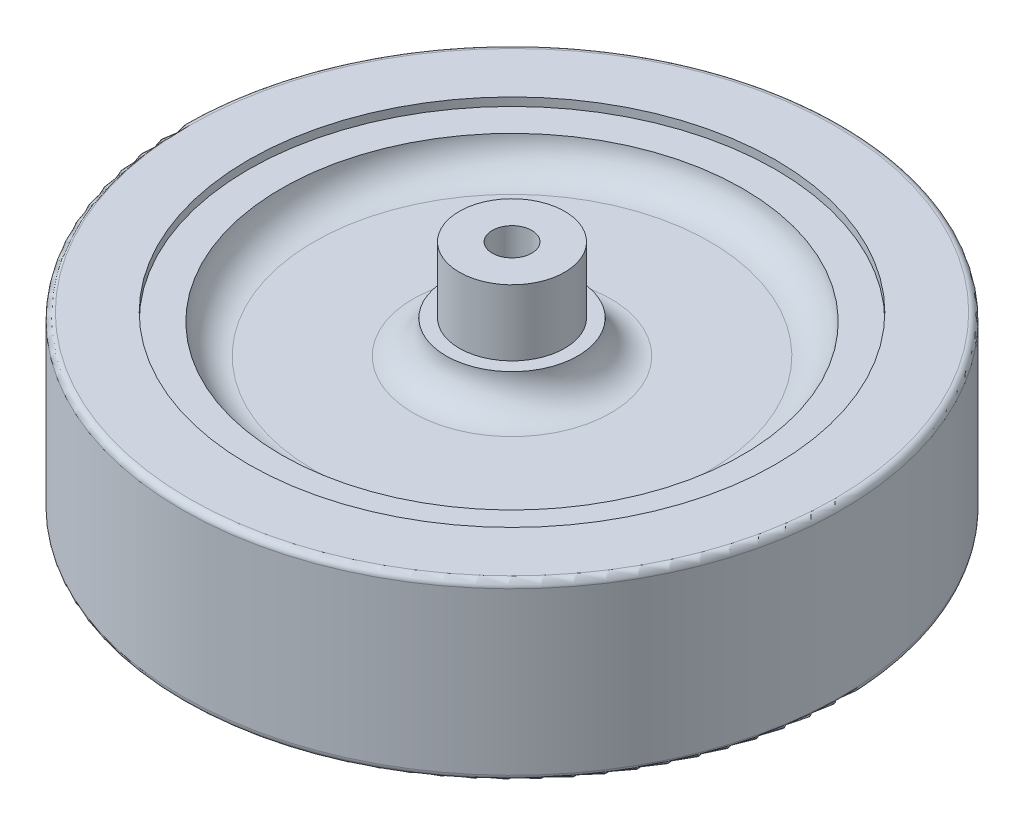
ISO-10303-21;
HEADER;
FILE_DESCRIPTION(('STEP AP214'),'2;1');
FILE_NAME('part.step','',(''),(''),'','','');
FILE_SCHEMA(('AUTOMOTIVE_DESIGN { 1 0 10303 214 1 1 1 1 }'));
ENDSEC;
DATA;
#1=APPLICATION_CONTEXT('core data for automotive mechanical design processes');
#2=APPLICATION_PROTOCOL_DEFINITION('international standard','automotive_design',2000,#1);
#3=PRODUCT_CONTEXT('',#1,'mechanical');
#4=PRODUCT('Part','Part','',(#3));
#5=PRODUCT_RELATED_PRODUCT_CATEGORY('part','',(#4));
#6=PRODUCT_DEFINITION_FORMATION('','',#4);
#7=PRODUCT_DEFINITION_CONTEXT('part definition',#1,'design');
#8=PRODUCT_DEFINITION('design','',#6,#7);
#9=PRODUCT_DEFINITION_SHAPE('','',#8);
#10=(LENGTH_UNIT() NAMED_UNIT(*) SI_UNIT(.MILLI.,.METRE.));
#11=(NAMED_UNIT(*) PLANE_ANGLE_UNIT() SI_UNIT($,.RADIAN.));
#12=(NAMED_UNIT(*) SI_UNIT($,.STERADIAN.) SOLID_ANGLE_UNIT());
#13=UNCERTAINTY_MEASURE_WITH_UNIT(LENGTH_MEASURE(1.E-05),#10,'distance_accuracy_value','');
#14=(GEOMETRIC_REPRESENTATION_CONTEXT(3) GLOBAL_UNCERTAINTY_ASSIGNED_CONTEXT((#13)) GLOBAL_UNIT_ASSIGNED_CONTEXT((#10,
#11,#12)) REPRESENTATION_CONTEXT('',''));
#15=CARTESIAN_POINT('',(0.,0.,0.));
#16=DIRECTION('',(0.,0.,1.));
#17=DIRECTION('',(1.,0.,0.));
#18=AXIS2_PLACEMENT_3D('',#15,#16,#17);
#19=CARTESIAN_POINT('',(0.,22.5,0.));
#20=DIRECTION('',(0.,1.,0.));
#21=DIRECTION('',(0.,0.,1.));
#22=AXIS2_PLACEMENT_3D('',#19,#20,#21);
#23=PLANE('',#22);
#24=CARTESIAN_POINT('',(0.,22.5,0.));
#25=DIRECTION('',(0.,1.,0.));
#26=DIRECTION('',(0.,0.,1.));
#27=AXIS2_PLACEMENT_3D('',#24,#25,#26);
#28=CIRCLE('',#27,8.);
#29=CARTESIAN_POINT('',(0.,22.5,8.));
#30=VERTEX_POINT('',#29);
#31=EDGE_CURVE('E87',#30,#30,#28,.T.);
#32=ORIENTED_EDGE('',*,*,#31,.T.);
#33=EDGE_LOOP('',(#32));
#34=FACE_BOUND('',#33,.T.);
#35=CARTESIAN_POINT('',(0.,22.5,0.));
#36=DIRECTION('',(0.,1.,0.));
#37=DIRECTION('',(0.,0.,1.));
#38=AXIS2_PLACEMENT_3D('',#35,#36,#37);
#39=CIRCLE('',#38,3.);
#40=CARTESIAN_POINT('',(0.,22.5,3.));
#41=VERTEX_POINT('',#40);
#42=EDGE_CURVE('E93',#41,#41,#39,.T.);
#43=ORIENTED_EDGE('',*,*,#42,.F.);
#44=EDGE_LOOP('',(#43));
#45=FACE_BOUND('',#44,.T.);
#46=ADVANCED_FACE('F33',(#34,#45),#23,.T.);
#47=CARTESIAN_POINT('',(0.,12.5,0.));
#48=DIRECTION('',(0.,1.,0.));
#49=DIRECTION('',(0.,0.,1.));
#50=AXIS2_PLACEMENT_3D('',#47,#48,#49);
#51=PLANE('',#50);
#52=CARTESIAN_POINT('',(0.,12.5,0.));
#53=DIRECTION('',(0.,1.,0.));
#54=DIRECTION('',(0.,0.,1.));
#55=AXIS2_PLACEMENT_3D('',#52,#53,#54);
#56=CIRCLE('',#55,10.);
#57=CARTESIAN_POINT('',(0.,12.5,10.));
#58=VERTEX_POINT('',#57);
#59=EDGE_CURVE('E81',#58,#58,#56,.T.);
#60=ORIENTED_EDGE('',*,*,#59,.T.);
#61=EDGE_LOOP('',(#60));
#62=FACE_BOUND('',#61,.T.);
#63=CARTESIAN_POINT('',(0.,12.5,0.));
#64=DIRECTION('',(0.,1.,0.));
#65=DIRECTION('',(0.,0.,1.));
#66=AXIS2_PLACEMENT_3D('',#63,#64,#65);
#67=CIRCLE('',#66,8.);
#68=CARTESIAN_POINT('',(0.,12.5,8.));
#69=VERTEX_POINT('',#68);
#70=EDGE_CURVE('E90',#69,#69,#67,.T.);
#71=ORIENTED_EDGE('',*,*,#70,.F.);
#72=EDGE_LOOP('',(#71));
#73=FACE_BOUND('',#72,.T.);
#74=ADVANCED_FACE('F106',(#62,#73),#51,.T.);
#75=CARTESIAN_POINT('',(0.,13.25,0.));
#76=DIRECTION('',(0.,-1.,0.));
#77=DIRECTION('',(0.,0.,-1.));
#78=AXIS2_PLACEMENT_3D('',#75,#76,#77);
#79=CYLINDRICAL_SURFACE('',#78,40.);
#80=CARTESIAN_POINT('',(0.,-13.25,0.));
#81=DIRECTION('',(0.,1.,0.));
#82=DIRECTION('',(0.,0.,1.));
#83=AXIS2_PLACEMENT_3D('',#80,#81,#82);
#84=CIRCLE('',#83,40.);
#85=CARTESIAN_POINT('',(0.,-13.25,40.));
#86=VERTEX_POINT('',#85);
#87=EDGE_CURVE('E69',#86,#86,#84,.T.);
#88=ORIENTED_EDGE('',*,*,#87,.F.);
#89=EDGE_LOOP('',(#88));
#90=FACE_BOUND('',#89,.T.);
#91=CARTESIAN_POINT('',(0.,-12.,0.));
#92=DIRECTION('',(0.,1.,0.));
#93=DIRECTION('',(0.,0.,1.));
#94=AXIS2_PLACEMENT_3D('',#91,#92,#93);
#95=CIRCLE('',#94,40.);
#96=CARTESIAN_POINT('',(0.,-12.,40.));
#97=VERTEX_POINT('',#96);
#98=EDGE_CURVE('E72',#97,#97,#95,.T.);
#99=ORIENTED_EDGE('',*,*,#98,.T.);
#100=EDGE_LOOP('',(#99));
#101=FACE_BOUND('',#100,.T.);
#102=ADVANCED_FACE('F112',(#90,#101),#79,.F.);
#103=CARTESIAN_POINT('',(0.,13.25,0.));
#104=DIRECTION('',(0.,1.,0.));
#105=DIRECTION('',(0.,0.,1.));
#106=AXIS2_PLACEMENT_3D('',#103,#104,#105);
#107=PLANE('',#106);
#108=CARTESIAN_POINT('',(0.,13.25,0.));
#109=DIRECTION('',(0.,1.,0.));
#110=DIRECTION('',(0.,0.,1.));
#111=AXIS2_PLACEMENT_3D('',#108,#109,#110);
#112=CIRCLE('',#111,49.);
#113=CARTESIAN_POINT('',(0.,13.25,49.));
#114=VERTEX_POINT('',#113);
#115=EDGE_CURVE('E10',#114,#114,#112,.T.);
#116=ORIENTED_EDGE('',*,*,#115,.T.);
#117=EDGE_LOOP('',(#116));
#118=FACE_BOUND('',#117,.T.);
#119=CARTESIAN_POINT('',(0.,13.25,0.));
#120=DIRECTION('',(0.,1.,0.));
#121=DIRECTION('',(0.,0.,1.));
#122=AXIS2_PLACEMENT_3D('',#119,#120,#121);
#123=CIRCLE('',#122,40.);
#124=CARTESIAN_POINT('',(0.,13.25,40.));
#125=VERTEX_POINT('',#124);
#126=EDGE_CURVE('E68',#125,#125,#123,.T.);
#127=ORIENTED_EDGE('',*,*,#126,.F.);
#128=EDGE_LOOP('',(#127));
#129=FACE_BOUND('',#128,.T.);
#130=ADVANCED_FACE('F149',(#118,#129),#107,.T.);
#131=CARTESIAN_POINT('',(0.,-13.25,0.));
#132=DIRECTION('',(0.,1.,0.));
#133=DIRECTION('',(0.,0.,1.));
#134=AXIS2_PLACEMENT_3D('',#131,#132,#133);
#135=PLANE('',#134);
#136=CARTESIAN_POINT('',(0.,-13.25,0.));
#137=DIRECTION('',(0.,1.,0.));
#138=DIRECTION('',(0.,0.,1.));
#139=AXIS2_PLACEMENT_3D('',#136,#137,#138);
#140=CIRCLE('',#139,49.);
#141=CARTESIAN_POINT('',(0.,-13.25,49.));
#142=VERTEX_POINT('',#141);
#143=EDGE_CURVE('E40',#142,#142,#140,.F.);
#144=ORIENTED_EDGE('',*,*,#143,.T.);
#145=EDGE_LOOP('',(#144));
#146=FACE_BOUND('',#145,.T.);
#147=ORIENTED_EDGE('',*,*,#87,.T.);
#148=EDGE_LOOP('',(#147));
#149=FACE_BOUND('',#148,.T.);
#150=ADVANCED_FACE('F152',(#146,#149),#135,.F.);
#151=CARTESIAN_POINT('',(0.,13.25,0.));
#152=DIRECTION('',(0.,-1.,0.));
#153=DIRECTION('',(0.,0.,-1.));
#154=AXIS2_PLACEMENT_3D('',#151,#152,#153);
#155=CYLINDRICAL_SURFACE('',#154,50.);
#156=CARTESIAN_POINT('',(0.,-12.25,0.));
#157=DIRECTION('',(0.,1.,0.));
#158=DIRECTION('',(0.,0.,1.));
#159=AXIS2_PLACEMENT_3D('',#156,#157,#158);
#160=CIRCLE('',#159,50.);
#161=CARTESIAN_POINT('',(0.,-12.25,50.));
#162=VERTEX_POINT('',#161);
#163=EDGE_CURVE('E44',#162,#162,#160,.T.);
#164=ORIENTED_EDGE('',*,*,#163,.T.);
#165=EDGE_LOOP('',(#164));
#166=FACE_BOUND('',#165,.T.);
#167=CARTESIAN_POINT('',(0.,12.25,0.));
#168=DIRECTION('',(0.,1.,0.));
#169=DIRECTION('',(0.,0.,1.));
#170=AXIS2_PLACEMENT_3D('',#167,#168,#169);
#171=CIRCLE('',#170,50.);
#172=CARTESIAN_POINT('',(0.,12.25,50.));
#173=VERTEX_POINT('',#172);
#174=EDGE_CURVE('E48',#173,#173,#171,.F.);
#175=ORIENTED_EDGE('',*,*,#174,.T.);
#176=EDGE_LOOP('',(#175));
#177=FACE_BOUND('',#176,.T.);
#178=ADVANCED_FACE('F147',(#166,#177),#155,.T.);
#179=CARTESIAN_POINT('',(0.,12.,0.));
#180=DIRECTION('',(0.,1.,0.));
#181=DIRECTION('',(0.,0.,1.));
#182=AXIS2_PLACEMENT_3D('',#179,#180,#181);
#183=CIRCLE('',#182,40.);
#184=CARTESIAN_POINT('',(0.,12.,40.));
#185=VERTEX_POINT('',#184);
#186=EDGE_CURVE('E65',#185,#185,#183,.T.);
#187=ORIENTED_EDGE('',*,*,#186,.F.);
#188=EDGE_LOOP('',(#187));
#189=FACE_BOUND('',#188,.T.);
#190=ORIENTED_EDGE('',*,*,#126,.T.);
#191=EDGE_LOOP('',(#190));
#192=FACE_BOUND('',#191,.T.);
#193=ADVANCED_FACE('F140',(#189,#192),#79,.F.);
#194=CARTESIAN_POINT('',(0.,12.,0.));
#195=DIRECTION('',(0.,1.,0.));
#196=DIRECTION('',(0.,0.,1.));
#197=AXIS2_PLACEMENT_3D('',#194,#195,#196);
#198=PLANE('',#197);
#199=ORIENTED_EDGE('',*,*,#186,.T.);
#200=EDGE_LOOP('',(#199));
#201=FACE_BOUND('',#200,.T.);
#202=CARTESIAN_POINT('',(0.,12.,0.));
#203=DIRECTION('',(0.,1.,0.));
#204=DIRECTION('',(0.,0.,1.));
#205=AXIS2_PLACEMENT_3D('',#202,#203,#204);
#206=CIRCLE('',#205,35.);
#207=CARTESIAN_POINT('',(0.,12.,35.));
#208=VERTEX_POINT('',#207);
#209=EDGE_CURVE('E77',#208,#208,#206,.T.);
#210=ORIENTED_EDGE('',*,*,#209,.F.);
#211=EDGE_LOOP('',(#210));
#212=FACE_BOUND('',#211,.T.);
#213=ADVANCED_FACE('F137',(#201,#212),#198,.T.);
#214=CARTESIAN_POINT('',(0.,-12.,0.));
#215=DIRECTION('',(0.,1.,0.));
#216=DIRECTION('',(0.,0.,1.));
#217=AXIS2_PLACEMENT_3D('',#214,#215,#216);
#218=PLANE('',#217);
#219=ORIENTED_EDGE('',*,*,#98,.F.);
#220=EDGE_LOOP('',(#219));
#221=FACE_BOUND('',#220,.T.);
#222=CARTESIAN_POINT('',(0.,-12.,0.));
#223=DIRECTION('',(0.,1.,0.));
#224=DIRECTION('',(0.,0.,1.));
#225=AXIS2_PLACEMENT_3D('',#222,#223,#224);
#226=CIRCLE('',#225,35.);
#227=CARTESIAN_POINT('',(0.,-12.,35.));
#228=VERTEX_POINT('',#227);
#229=EDGE_CURVE('E78',#228,#228,#226,.T.);
#230=ORIENTED_EDGE('',*,*,#229,.T.);
#231=EDGE_LOOP('',(#230));
#232=FACE_BOUND('',#231,.T.);
#233=ADVANCED_FACE('F132',(#221,#232),#218,.F.);
#234=CARTESIAN_POINT('',(0.,7.5,0.));
#235=DIRECTION('',(0.,1.,0.));
#236=DIRECTION('',(0.,0.,1.));
#237=AXIS2_PLACEMENT_3D('',#234,#235,#236);
#238=PLANE('',#237);
#239=CARTESIAN_POINT('',(0.,7.5,0.));
#240=DIRECTION('',(0.,1.,0.));
#241=DIRECTION('',(0.,0.,1.));
#242=AXIS2_PLACEMENT_3D('',#239,#240,#241);
#243=CIRCLE('',#242,15.);
#244=CARTESIAN_POINT('',(0.,7.5,15.));
#245=VERTEX_POINT('',#244);
#246=EDGE_CURVE('E53',#245,#245,#243,.F.);
#247=ORIENTED_EDGE('',*,*,#246,.T.);
#248=EDGE_LOOP('',(#247));
#249=FACE_BOUND('',#248,.T.);
#250=CARTESIAN_POINT('',(0.,7.5,0.));
#251=DIRECTION('',(0.,1.,0.));
#252=DIRECTION('',(0.,0.,1.));
#253=AXIS2_PLACEMENT_3D('',#250,#251,#252);
#254=CIRCLE('',#253,30.0250628144669);
#255=CARTESIAN_POINT('',(0.,7.5,30.0250628144669));
#256=VERTEX_POINT('',#255);
#257=EDGE_CURVE('E56',#256,#256,#254,.T.);
#258=ORIENTED_EDGE('',*,*,#257,.T.);
#259=EDGE_LOOP('',(#258));
#260=FACE_BOUND('',#259,.T.);
#261=ADVANCED_FACE('F129',(#249,#260),#238,.T.);
#262=CARTESIAN_POINT('',(0.,-7.5,0.));
#263=DIRECTION('',(0.,1.,0.));
#264=DIRECTION('',(0.,0.,1.));
#265=AXIS2_PLACEMENT_3D('',#262,#263,#264);
#266=PLANE('',#265);
#267=CARTESIAN_POINT('',(0.,-7.5,0.));
#268=DIRECTION('',(0.,1.,0.));
#269=DIRECTION('',(0.,0.,1.));
#270=AXIS2_PLACEMENT_3D('',#267,#268,#269);
#271=CIRCLE('',#270,30.0250628144669);
#272=CARTESIAN_POINT('',(0.,-7.5,30.0250628144669));
#273=VERTEX_POINT('',#272);
#274=EDGE_CURVE('E59',#273,#273,#271,.F.);
#275=ORIENTED_EDGE('',*,*,#274,.T.);
#276=EDGE_LOOP('',(#275));
#277=FACE_BOUND('',#276,.T.);
#278=CARTESIAN_POINT('',(0.,-7.5,0.));
#279=DIRECTION('',(0.,1.,0.));
#280=DIRECTION('',(0.,0.,1.));
#281=AXIS2_PLACEMENT_3D('',#278,#279,#280);
#282=CIRCLE('',#281,15.);
#283=CARTESIAN_POINT('',(0.,-7.5,15.));
#284=VERTEX_POINT('',#283);
#285=EDGE_CURVE('E62',#284,#284,#282,.T.);
#286=ORIENTED_EDGE('',*,*,#285,.T.);
#287=EDGE_LOOP('',(#286));
#288=FACE_BOUND('',#287,.T.);
#289=ADVANCED_FACE('F127',(#277,#288),#266,.F.);
#290=CARTESIAN_POINT('',(0.,-12.5,0.));
#291=DIRECTION('',(0.,1.,0.));
#292=DIRECTION('',(0.,0.,1.));
#293=AXIS2_PLACEMENT_3D('',#290,#291,#292);
#294=PLANE('',#293);
#295=CARTESIAN_POINT('',(0.,-12.5,0.));
#296=DIRECTION('',(0.,1.,0.));
#297=DIRECTION('',(0.,0.,1.));
#298=AXIS2_PLACEMENT_3D('',#295,#296,#297);
#299=CIRCLE('',#298,10.);
#300=CARTESIAN_POINT('',(0.,-12.5,10.));
#301=VERTEX_POINT('',#300);
#302=EDGE_CURVE('E84',#301,#301,#299,.T.);
#303=ORIENTED_EDGE('',*,*,#302,.F.);
#304=EDGE_LOOP('',(#303));
#305=FACE_BOUND('',#304,.T.);
#306=ADVANCED_FACE('F123',(#305),#294,.F.);
#307=CARTESIAN_POINT('',(0.,-12.5,0.));
#308=DIRECTION('',(0.,-1.,0.));
#309=DIRECTION('',(0.,0.,-1.));
#310=AXIS2_PLACEMENT_3D('',#307,#308,#309);
#311=TOROIDAL_SURFACE('',#310,30.0250628144669,5.);
#312=ORIENTED_EDGE('',*,*,#274,.F.);
#313=EDGE_LOOP('',(#312));
#314=FACE_BOUND('',#313,.T.);
#315=ORIENTED_EDGE('',*,*,#229,.F.);
#316=EDGE_LOOP('',(#315));
#317=FACE_BOUND('',#316,.T.);
#318=ADVANCED_FACE('F126',(#314,#317),#311,.F.);
#319=CARTESIAN_POINT('',(0.,-12.5,0.));
#320=DIRECTION('',(0.,1.,0.));
#321=DIRECTION('',(0.,0.,1.));
#322=AXIS2_PLACEMENT_3D('',#319,#320,#321);
#323=TOROIDAL_SURFACE('',#322,15.,5.);
#324=ORIENTED_EDGE('',*,*,#285,.F.);
#325=EDGE_LOOP('',(#324));
#326=FACE_BOUND('',#325,.T.);
#327=ORIENTED_EDGE('',*,*,#302,.T.);
#328=EDGE_LOOP('',(#327));
#329=FACE_BOUND('',#328,.T.);
#330=ADVANCED_FACE('F160',(#326,#329),#323,.F.);
#331=CARTESIAN_POINT('',(0.,12.5,0.));
#332=DIRECTION('',(0.,1.,0.));
#333=DIRECTION('',(0.,0.,1.));
#334=AXIS2_PLACEMENT_3D('',#331,#332,#333);
#335=TOROIDAL_SURFACE('',#334,15.,5.);
#336=ORIENTED_EDGE('',*,*,#246,.F.);
#337=EDGE_LOOP('',(#336));
#338=FACE_BOUND('',#337,.T.);
#339=ORIENTED_EDGE('',*,*,#59,.F.);
#340=EDGE_LOOP('',(#339));
#341=FACE_BOUND('',#340,.T.);
#342=ADVANCED_FACE('F164',(#338,#341),#335,.F.);
#343=CARTESIAN_POINT('',(0.,12.5,0.));
#344=DIRECTION('',(0.,-1.,0.));
#345=DIRECTION('',(0.,0.,-1.));
#346=AXIS2_PLACEMENT_3D('',#343,#344,#345);
#347=TOROIDAL_SURFACE('',#346,30.0250628144669,5.);
#348=ORIENTED_EDGE('',*,*,#209,.T.);
#349=EDGE_LOOP('',(#348));
#350=FACE_BOUND('',#349,.T.);
#351=ORIENTED_EDGE('',*,*,#257,.F.);
#352=EDGE_LOOP('',(#351));
#353=FACE_BOUND('',#352,.T.);
#354=ADVANCED_FACE('F120',(#350,#353),#347,.F.);
#355=CARTESIAN_POINT('',(0.,22.5,0.));
#356=DIRECTION('',(0.,-1.,0.));
#357=DIRECTION('',(0.,0.,-1.));
#358=AXIS2_PLACEMENT_3D('',#355,#356,#357);
#359=CYLINDRICAL_SURFACE('',#358,8.);
#360=ORIENTED_EDGE('',*,*,#31,.F.);
#361=EDGE_LOOP('',(#360));
#362=FACE_BOUND('',#361,.T.);
#363=ORIENTED_EDGE('',*,*,#70,.T.);
#364=EDGE_LOOP('',(#363));
#365=FACE_BOUND('',#364,.T.);
#366=ADVANCED_FACE('F118',(#362,#365),#359,.T.);
#367=CARTESIAN_POINT('',(0.,22.5,0.));
#368=DIRECTION('',(0.,-1.,0.));
#369=DIRECTION('',(0.,0.,-1.));
#370=AXIS2_PLACEMENT_3D('',#367,#368,#369);
#371=CYLINDRICAL_SURFACE('',#370,3.);
#372=ORIENTED_EDGE('',*,*,#42,.T.);
#373=EDGE_LOOP('',(#372));
#374=FACE_BOUND('',#373,.T.);
#375=CARTESIAN_POINT('',(0.,12.5,0.));
#376=DIRECTION('',(0.,1.,0.));
#377=DIRECTION('',(0.,0.,1.));
#378=AXIS2_PLACEMENT_3D('',#375,#376,#377);
#379=CIRCLE('',#378,3.);
#380=CARTESIAN_POINT('',(0.,12.5,3.));
#381=VERTEX_POINT('',#380);
#382=EDGE_CURVE('E96',#381,#381,#379,.T.);
#383=ORIENTED_EDGE('',*,*,#382,.F.);
#384=EDGE_LOOP('',(#383));
#385=FACE_BOUND('',#384,.T.);
#386=ADVANCED_FACE('F102',(#374,#385),#371,.F.);
#387=CARTESIAN_POINT('',(0.,12.5,0.));
#388=DIRECTION('',(0.,1.,0.));
#389=DIRECTION('',(0.,0.,1.));
#390=AXIS2_PLACEMENT_3D('',#387,#388,#389);
#391=PLANE('',#390);
#392=ORIENTED_EDGE('',*,*,#382,.T.);
#393=EDGE_LOOP('',(#392));
#394=FACE_BOUND('',#393,.T.);
#395=ADVANCED_FACE('F173',(#394),#391,.T.);
#396=CARTESIAN_POINT('',(0.,-12.25,0.));
#397=DIRECTION('',(0.,1.,0.));
#398=DIRECTION('',(0.,0.,1.));
#399=AXIS2_PLACEMENT_3D('',#396,#397,#398);
#400=TOROIDAL_SURFACE('',#399,49.,1.);
#401=ORIENTED_EDGE('',*,*,#143,.F.);
#402=EDGE_LOOP('',(#401));
#403=FACE_BOUND('',#402,.T.);
#404=ORIENTED_EDGE('',*,*,#163,.F.);
#405=EDGE_LOOP('',(#404));
#406=FACE_BOUND('',#405,.T.);
#407=ADVANCED_FACE('F171',(#403,#406),#400,.T.);
#408=CARTESIAN_POINT('',(0.,12.25,0.));
#409=DIRECTION('',(0.,1.,0.));
#410=DIRECTION('',(0.,0.,1.));
#411=AXIS2_PLACEMENT_3D('',#408,#409,#410);
#412=TOROIDAL_SURFACE('',#411,49.,1.);
#413=ORIENTED_EDGE('',*,*,#174,.F.);
#414=EDGE_LOOP('',(#413));
#415=FACE_BOUND('',#414,.T.);
#416=ORIENTED_EDGE('',*,*,#115,.F.);
#417=EDGE_LOOP('',(#416));
#418=FACE_BOUND('',#417,.T.);
#419=ADVANCED_FACE('F35',(#415,#418),#412,.T.);
#420=CLOSED_SHELL('',(#46,#74,#102,#130,#150,#178,#193,#213,#233,#261,#289,#306,#318,#330,#342,
#354,#366,#386,#395,#407,#419));
#421=MANIFOLD_SOLID_BREP('B2',#420);
#422=ADVANCED_BREP_SHAPE_REPRESENTATION('',(#18,#421),#14);
#423=SHAPE_DEFINITION_REPRESENTATION(#9,#422);
ENDSEC;
END-ISO-10303-21;
